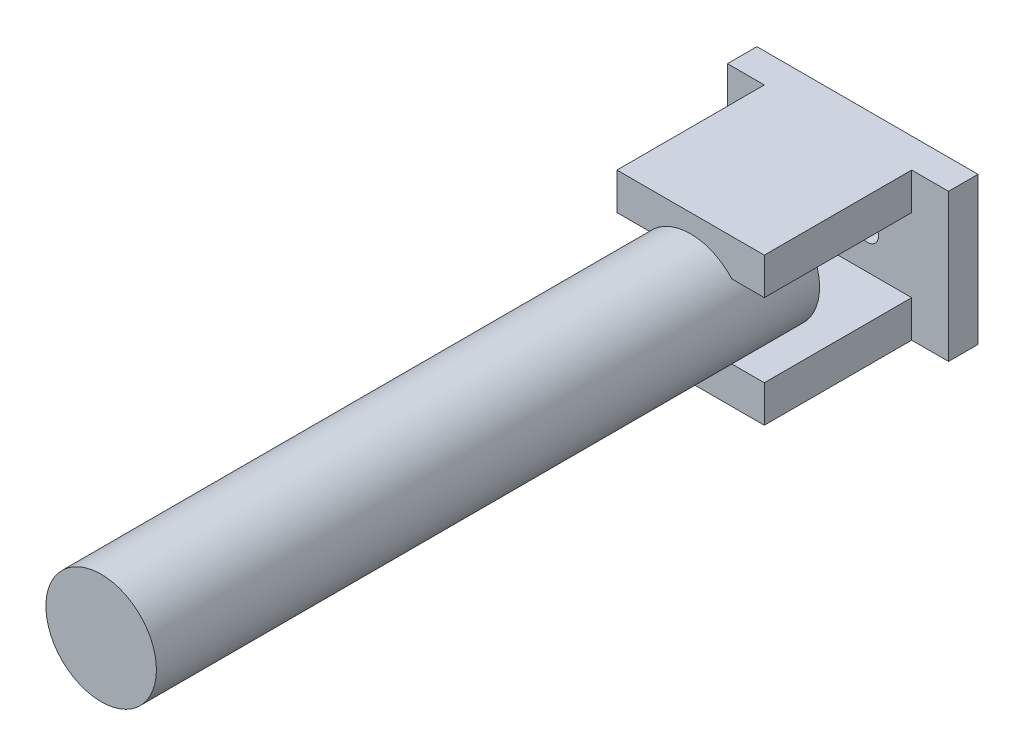
ISO-10303-21;
HEADER;
FILE_DESCRIPTION(('STEP AP214'),'2;1');
FILE_NAME('part.step','',(''),(''),'','','');
FILE_SCHEMA(('AUTOMOTIVE_DESIGN { 1 0 10303 214 1 1 1 1 }'));
ENDSEC;
DATA;
#1=APPLICATION_CONTEXT('core data for automotive mechanical design processes');
#2=APPLICATION_PROTOCOL_DEFINITION('international standard','automotive_design',2000,#1);
#3=PRODUCT_CONTEXT('',#1,'mechanical');
#4=PRODUCT('Part','Part','',(#3));
#5=PRODUCT_RELATED_PRODUCT_CATEGORY('part','',(#4));
#6=PRODUCT_DEFINITION_FORMATION('','',#4);
#7=PRODUCT_DEFINITION_CONTEXT('part definition',#1,'design');
#8=PRODUCT_DEFINITION('design','',#6,#7);
#9=PRODUCT_DEFINITION_SHAPE('','',#8);
#10=(LENGTH_UNIT() NAMED_UNIT(*) SI_UNIT(.MILLI.,.METRE.));
#11=(NAMED_UNIT(*) PLANE_ANGLE_UNIT() SI_UNIT($,.RADIAN.));
#12=(NAMED_UNIT(*) SI_UNIT($,.STERADIAN.) SOLID_ANGLE_UNIT());
#13=UNCERTAINTY_MEASURE_WITH_UNIT(LENGTH_MEASURE(1.E-05),#10,'distance_accuracy_value','');
#14=(GEOMETRIC_REPRESENTATION_CONTEXT(3) GLOBAL_UNCERTAINTY_ASSIGNED_CONTEXT((#13)) GLOBAL_UNIT_ASSIGNED_CONTEXT((#10,
#11,#12)) REPRESENTATION_CONTEXT('',''));
#15=CARTESIAN_POINT('',(0.,0.,0.));
#16=DIRECTION('',(0.,0.,1.));
#17=DIRECTION('',(1.,0.,0.));
#18=AXIS2_PLACEMENT_3D('',#15,#16,#17);
#19=CARTESIAN_POINT('',(0.,0.,4.));
#20=DIRECTION('',(0.,0.,1.));
#21=DIRECTION('',(1.,0.,0.));
#22=AXIS2_PLACEMENT_3D('',#19,#20,#21);
#23=PLANE('',#22);
#24=CARTESIAN_POINT('',(5.09714285714285,0.694285714285715,4.));
#25=DIRECTION('',(0.,0.,1.));
#26=DIRECTION('',(1.,0.,0.));
#27=AXIS2_PLACEMENT_3D('',#24,#25,#26);
#28=CIRCLE('',#27,1.5);
#29=CARTESIAN_POINT('',(6.59714285714285,0.694285714285715,4.));
#30=VERTEX_POINT('',#29);
#31=EDGE_CURVE('E191',#30,#30,#28,.T.);
#32=ORIENTED_EDGE('',*,*,#31,.F.);
#33=EDGE_LOOP('',(#32));
#34=FACE_BOUND('',#33,.T.);
#35=CARTESIAN_POINT('',(-2.90285714285715,0.694285714285715,4.));
#36=DIRECTION('',(0.,0.,1.));
#37=DIRECTION('',(1.,0.,0.));
#38=AXIS2_PLACEMENT_3D('',#35,#36,#37);
#39=CIRCLE('',#38,1.5);
#40=CARTESIAN_POINT('',(-1.40285714285715,0.694285714285715,4.));
#41=VERTEX_POINT('',#40);
#42=EDGE_CURVE('E220',#41,#41,#39,.T.);
#43=ORIENTED_EDGE('',*,*,#42,.F.);
#44=EDGE_LOOP('',(#43));
#45=FACE_BOUND('',#44,.T.);
#46=DIRECTION('',(1.,0.,0.));
#47=VECTOR('',#46,1.);
#48=CARTESIAN_POINT('',(0.,-9.30571428571429,4.));
#49=LINE('',#48,#47);
#50=CARTESIAN_POINT('',(-13.9028571428571,-9.30571428571429,4.));
#51=VERTEX_POINT('',#50);
#52=CARTESIAN_POINT('',(-8.90285714285714,-9.30571428571429,4.));
#53=VERTEX_POINT('',#52);
#54=EDGE_CURVE('E187',#51,#53,#49,.T.);
#55=ORIENTED_EDGE('',*,*,#54,.T.);
#56=DIRECTION('',(0.,-1.,0.));
#57=VECTOR('',#56,1.);
#58=CARTESIAN_POINT('',(-8.90285714285714,0.,4.));
#59=LINE('',#58,#57);
#60=CARTESIAN_POINT('',(-8.90285714285714,-4.30571428571429,4.));
#61=VERTEX_POINT('',#60);
#62=EDGE_CURVE('E267',#61,#53,#59,.T.);
#63=ORIENTED_EDGE('',*,*,#62,.F.);
#64=DIRECTION('',(1.,0.,0.));
#65=VECTOR('',#64,1.);
#66=CARTESIAN_POINT('',(0.,-4.30571428571429,4.));
#67=LINE('',#66,#65);
#68=CARTESIAN_POINT('',(11.0971428571429,-4.30571428571429,4.));
#69=VERTEX_POINT('',#68);
#70=EDGE_CURVE('E270',#61,#69,#67,.T.);
#71=ORIENTED_EDGE('',*,*,#70,.T.);
#72=DIRECTION('',(0.,-1.,0.));
#73=VECTOR('',#72,1.);
#74=CARTESIAN_POINT('',(11.0971428571429,0.,4.));
#75=LINE('',#74,#73);
#76=CARTESIAN_POINT('',(11.0971428571429,-9.30571428571429,4.));
#77=VERTEX_POINT('',#76);
#78=EDGE_CURVE('E162',#69,#77,#75,.T.);
#79=ORIENTED_EDGE('',*,*,#78,.T.);
#80=CARTESIAN_POINT('',(16.0971428571429,-9.30571428571429,4.));
#81=VERTEX_POINT('',#80);
#82=EDGE_CURVE('E209',#77,#81,#49,.T.);
#83=ORIENTED_EDGE('',*,*,#82,.T.);
#84=DIRECTION('',(0.,-1.,0.));
#85=VECTOR('',#84,1.);
#86=CARTESIAN_POINT('',(16.0971428571429,0.,4.));
#87=LINE('',#86,#85);
#88=CARTESIAN_POINT('',(16.0971428571429,10.6942857142857,4.));
#89=VERTEX_POINT('',#88);
#90=EDGE_CURVE('E217',#89,#81,#87,.T.);
#91=ORIENTED_EDGE('',*,*,#90,.F.);
#92=DIRECTION('',(1.,0.,0.));
#93=VECTOR('',#92,1.);
#94=CARTESIAN_POINT('',(0.,10.6942857142857,4.));
#95=LINE('',#94,#93);
#96=CARTESIAN_POINT('',(11.0971428571429,10.6942857142857,4.));
#97=VERTEX_POINT('',#96);
#98=EDGE_CURVE('E216',#97,#89,#95,.T.);
#99=ORIENTED_EDGE('',*,*,#98,.F.);
#100=DIRECTION('',(0.,-1.,0.));
#101=VECTOR('',#100,1.);
#102=CARTESIAN_POINT('',(11.0971428571429,0.,4.));
#103=LINE('',#102,#101);
#104=CARTESIAN_POINT('',(11.0971428571429,5.69428571428571,4.));
#105=VERTEX_POINT('',#104);
#106=EDGE_CURVE('E244',#97,#105,#103,.T.);
#107=ORIENTED_EDGE('',*,*,#106,.T.);
#108=DIRECTION('',(1.,0.,0.));
#109=VECTOR('',#108,1.);
#110=CARTESIAN_POINT('',(0.,5.69428571428571,4.));
#111=LINE('',#110,#109);
#112=CARTESIAN_POINT('',(-8.90285714285714,5.69428571428571,4.));
#113=VERTEX_POINT('',#112);
#114=EDGE_CURVE('E237',#113,#105,#111,.T.);
#115=ORIENTED_EDGE('',*,*,#114,.F.);
#116=DIRECTION('',(0.,-1.,0.));
#117=VECTOR('',#116,1.);
#118=CARTESIAN_POINT('',(-8.90285714285714,0.,4.));
#119=LINE('',#118,#117);
#120=CARTESIAN_POINT('',(-8.90285714285714,10.6942857142857,4.));
#121=VERTEX_POINT('',#120);
#122=EDGE_CURVE('E241',#121,#113,#119,.T.);
#123=ORIENTED_EDGE('',*,*,#122,.F.);
#124=CARTESIAN_POINT('',(-13.9028571428571,10.6942857142857,4.));
#125=VERTEX_POINT('',#124);
#126=EDGE_CURVE('E213',#125,#121,#95,.T.);
#127=ORIENTED_EDGE('',*,*,#126,.F.);
#128=DIRECTION('',(0.,-1.,0.));
#129=VECTOR('',#128,1.);
#130=CARTESIAN_POINT('',(-13.9028571428571,0.,4.));
#131=LINE('',#130,#129);
#132=EDGE_CURVE('E210',#125,#51,#131,.T.);
#133=ORIENTED_EDGE('',*,*,#132,.T.);
#134=EDGE_LOOP('',(#55,#63,#71,#79,#83,#91,#99,#107,#115,#123,#127,#133));
#135=FACE_BOUND('',#134,.T.);
#136=ADVANCED_FACE('F39',(#34,#45,#135),#23,.T.);
#137=CARTESIAN_POINT('',(16.0971428571429,0.,4.));
#138=DIRECTION('',(1.,0.,0.));
#139=DIRECTION('',(0.,1.,0.));
#140=AXIS2_PLACEMENT_3D('',#137,#138,#139);
#141=PLANE('',#140);
#142=DIRECTION('',(0.,-1.,0.));
#143=VECTOR('',#142,1.);
#144=CARTESIAN_POINT('',(16.0971428571429,0.,0.));
#145=LINE('',#144,#143);
#146=CARTESIAN_POINT('',(16.0971428571429,10.6942857142857,0.));
#147=VERTEX_POINT('',#146);
#148=CARTESIAN_POINT('',(16.0971428571429,-9.30571428571429,0.));
#149=VERTEX_POINT('',#148);
#150=EDGE_CURVE('E198',#147,#149,#145,.T.);
#151=ORIENTED_EDGE('',*,*,#150,.F.);
#152=DIRECTION('',(0.,0.,-1.));
#153=VECTOR('',#152,1.);
#154=CARTESIAN_POINT('',(16.0971428571429,10.6942857142857,4.));
#155=LINE('',#154,#153);
#156=EDGE_CURVE('E177',#89,#147,#155,.T.);
#157=ORIENTED_EDGE('',*,*,#156,.F.);
#158=ORIENTED_EDGE('',*,*,#90,.T.);
#159=DIRECTION('',(0.,0.,-1.));
#160=VECTOR('',#159,1.);
#161=CARTESIAN_POINT('',(16.0971428571429,-9.30571428571429,4.));
#162=LINE('',#161,#160);
#163=EDGE_CURVE('E185',#81,#149,#162,.T.);
#164=ORIENTED_EDGE('',*,*,#163,.T.);
#165=EDGE_LOOP('',(#151,#157,#158,#164));
#166=FACE_BOUND('',#165,.T.);
#167=ADVANCED_FACE('F305',(#166),#141,.T.);
#168=CARTESIAN_POINT('',(0.,10.6942857142857,4.));
#169=DIRECTION('',(0.,1.,0.));
#170=DIRECTION('',(0.,0.,1.));
#171=AXIS2_PLACEMENT_3D('',#168,#169,#170);
#172=PLANE('',#171);
#173=DIRECTION('',(1.,0.,0.));
#174=VECTOR('',#173,1.);
#175=CARTESIAN_POINT('',(0.,10.6942857142857,0.));
#176=LINE('',#175,#174);
#177=CARTESIAN_POINT('',(-13.9028571428571,10.6942857142857,0.));
#178=VERTEX_POINT('',#177);
#179=EDGE_CURVE('E195',#178,#147,#176,.T.);
#180=ORIENTED_EDGE('',*,*,#179,.F.);
#181=DIRECTION('',(0.,0.,-1.));
#182=VECTOR('',#181,1.);
#183=CARTESIAN_POINT('',(-13.9028571428571,10.6942857142857,4.));
#184=LINE('',#183,#182);
#185=EDGE_CURVE('E178',#125,#178,#184,.T.);
#186=ORIENTED_EDGE('',*,*,#185,.F.);
#187=ORIENTED_EDGE('',*,*,#126,.T.);
#188=DIRECTION('',(0.,0.,-1.));
#189=VECTOR('',#188,1.);
#190=CARTESIAN_POINT('',(-8.90285714285714,10.6942857142857,24.));
#191=LINE('',#190,#189);
#192=CARTESIAN_POINT('',(-8.90285714285714,10.6942857142857,24.));
#193=VERTEX_POINT('',#192);
#194=EDGE_CURVE('E227',#193,#121,#191,.T.);
#195=ORIENTED_EDGE('',*,*,#194,.F.);
#196=DIRECTION('',(-1.,0.,0.));
#197=VECTOR('',#196,1.);
#198=CARTESIAN_POINT('',(0.,10.6942857142857,24.));
#199=LINE('',#198,#197);
#200=CARTESIAN_POINT('',(11.0971428571429,10.6942857142857,24.));
#201=VERTEX_POINT('',#200);
#202=EDGE_CURVE('E251',#201,#193,#199,.T.);
#203=ORIENTED_EDGE('',*,*,#202,.F.);
#204=DIRECTION('',(0.,0.,-1.));
#205=VECTOR('',#204,1.);
#206=CARTESIAN_POINT('',(11.0971428571429,10.6942857142857,24.));
#207=LINE('',#206,#205);
#208=EDGE_CURVE('E207',#201,#97,#207,.T.);
#209=ORIENTED_EDGE('',*,*,#208,.T.);
#210=ORIENTED_EDGE('',*,*,#98,.T.);
#211=ORIENTED_EDGE('',*,*,#156,.T.);
#212=EDGE_LOOP('',(#180,#186,#187,#195,#203,#209,#210,#211));
#213=FACE_BOUND('',#212,.T.);
#214=ADVANCED_FACE('F311',(#213),#172,.T.);
#215=CARTESIAN_POINT('',(-13.9028571428571,0.,4.));
#216=DIRECTION('',(1.,0.,0.));
#217=DIRECTION('',(0.,1.,0.));
#218=AXIS2_PLACEMENT_3D('',#215,#216,#217);
#219=PLANE('',#218);
#220=DIRECTION('',(0.,-1.,0.));
#221=VECTOR('',#220,1.);
#222=CARTESIAN_POINT('',(-13.9028571428571,0.,0.));
#223=LINE('',#222,#221);
#224=CARTESIAN_POINT('',(-13.9028571428571,-9.30571428571429,0.));
#225=VERTEX_POINT('',#224);
#226=EDGE_CURVE('E192',#178,#225,#223,.T.);
#227=ORIENTED_EDGE('',*,*,#226,.T.);
#228=DIRECTION('',(0.,0.,-1.));
#229=VECTOR('',#228,1.);
#230=CARTESIAN_POINT('',(-13.9028571428571,-9.30571428571429,4.));
#231=LINE('',#230,#229);
#232=EDGE_CURVE('E182',#51,#225,#231,.T.);
#233=ORIENTED_EDGE('',*,*,#232,.F.);
#234=ORIENTED_EDGE('',*,*,#132,.F.);
#235=ORIENTED_EDGE('',*,*,#185,.T.);
#236=EDGE_LOOP('',(#227,#233,#234,#235));
#237=FACE_BOUND('',#236,.T.);
#238=ADVANCED_FACE('F328',(#237),#219,.F.);
#239=CARTESIAN_POINT('',(-2.90285714285715,0.694285714285715,4.));
#240=DIRECTION('',(0.,0.,-1.));
#241=DIRECTION('',(-1.,0.,0.));
#242=AXIS2_PLACEMENT_3D('',#239,#240,#241);
#243=CYLINDRICAL_SURFACE('',#242,1.5);
#244=ORIENTED_EDGE('',*,*,#42,.T.);
#245=EDGE_LOOP('',(#244));
#246=FACE_BOUND('',#245,.T.);
#247=CARTESIAN_POINT('',(-2.90285714285715,0.694285714285715,0.));
#248=DIRECTION('',(0.,0.,1.));
#249=DIRECTION('',(1.,0.,0.));
#250=AXIS2_PLACEMENT_3D('',#247,#248,#249);
#251=CIRCLE('',#250,1.5);
#252=CARTESIAN_POINT('',(-1.40285714285715,0.694285714285715,0.));
#253=VERTEX_POINT('',#252);
#254=EDGE_CURVE('E201',#253,#253,#251,.T.);
#255=ORIENTED_EDGE('',*,*,#254,.F.);
#256=EDGE_LOOP('',(#255));
#257=FACE_BOUND('',#256,.T.);
#258=ADVANCED_FACE('F331',(#246,#257),#243,.F.);
#259=CARTESIAN_POINT('',(5.09714285714285,0.694285714285715,4.));
#260=DIRECTION('',(0.,0.,-1.));
#261=DIRECTION('',(-1.,0.,0.));
#262=AXIS2_PLACEMENT_3D('',#259,#260,#261);
#263=CYLINDRICAL_SURFACE('',#262,1.5);
#264=ORIENTED_EDGE('',*,*,#31,.T.);
#265=EDGE_LOOP('',(#264));
#266=FACE_BOUND('',#265,.T.);
#267=CARTESIAN_POINT('',(5.09714285714285,0.694285714285715,0.));
#268=DIRECTION('',(0.,0.,1.));
#269=DIRECTION('',(1.,0.,0.));
#270=AXIS2_PLACEMENT_3D('',#267,#268,#269);
#271=CIRCLE('',#270,1.5);
#272=CARTESIAN_POINT('',(6.59714285714285,0.694285714285715,0.));
#273=VERTEX_POINT('',#272);
#274=EDGE_CURVE('E204',#273,#273,#271,.T.);
#275=ORIENTED_EDGE('',*,*,#274,.F.);
#276=EDGE_LOOP('',(#275));
#277=FACE_BOUND('',#276,.T.);
#278=ADVANCED_FACE('F41',(#266,#277),#263,.F.);
#279=CARTESIAN_POINT('',(0.,-9.30571428571429,4.));
#280=DIRECTION('',(0.,1.,0.));
#281=DIRECTION('',(0.,0.,1.));
#282=AXIS2_PLACEMENT_3D('',#279,#280,#281);
#283=PLANE('',#282);
#284=DIRECTION('',(1.,0.,0.));
#285=VECTOR('',#284,1.);
#286=CARTESIAN_POINT('',(0.,-9.30571428571429,0.));
#287=LINE('',#286,#285);
#288=EDGE_CURVE('E188',#225,#149,#287,.T.);
#289=ORIENTED_EDGE('',*,*,#288,.T.);
#290=ORIENTED_EDGE('',*,*,#163,.F.);
#291=ORIENTED_EDGE('',*,*,#82,.F.);
#292=DIRECTION('',(0.,0.,-1.));
#293=VECTOR('',#292,1.);
#294=CARTESIAN_POINT('',(11.0971428571429,-9.30571428571429,24.));
#295=LINE('',#294,#293);
#296=CARTESIAN_POINT('',(11.0971428571429,-9.30571428571429,24.));
#297=VERTEX_POINT('',#296);
#298=EDGE_CURVE('E260',#297,#77,#295,.T.);
#299=ORIENTED_EDGE('',*,*,#298,.F.);
#300=DIRECTION('',(1.,0.,0.));
#301=VECTOR('',#300,1.);
#302=CARTESIAN_POINT('',(0.,-9.30571428571429,24.));
#303=LINE('',#302,#301);
#304=CARTESIAN_POINT('',(-8.90285714285714,-9.30571428571429,24.));
#305=VERTEX_POINT('',#304);
#306=EDGE_CURVE('E273',#305,#297,#303,.T.);
#307=ORIENTED_EDGE('',*,*,#306,.F.);
#308=DIRECTION('',(0.,0.,-1.));
#309=VECTOR('',#308,1.);
#310=CARTESIAN_POINT('',(-8.90285714285714,-9.30571428571429,24.));
#311=LINE('',#310,#309);
#312=EDGE_CURVE('E257',#305,#53,#311,.T.);
#313=ORIENTED_EDGE('',*,*,#312,.T.);
#314=ORIENTED_EDGE('',*,*,#54,.F.);
#315=ORIENTED_EDGE('',*,*,#232,.T.);
#316=EDGE_LOOP('',(#289,#290,#291,#299,#307,#313,#314,#315));
#317=FACE_BOUND('',#316,.T.);
#318=ADVANCED_FACE('F323',(#317),#283,.F.);
#319=CARTESIAN_POINT('',(0.,0.,0.));
#320=DIRECTION('',(0.,0.,1.));
#321=DIRECTION('',(1.,0.,0.));
#322=AXIS2_PLACEMENT_3D('',#319,#320,#321);
#323=PLANE('',#322);
#324=ORIENTED_EDGE('',*,*,#274,.T.);
#325=EDGE_LOOP('',(#324));
#326=FACE_BOUND('',#325,.T.);
#327=ORIENTED_EDGE('',*,*,#254,.T.);
#328=EDGE_LOOP('',(#327));
#329=FACE_BOUND('',#328,.T.);
#330=ORIENTED_EDGE('',*,*,#150,.T.);
#331=ORIENTED_EDGE('',*,*,#288,.F.);
#332=ORIENTED_EDGE('',*,*,#226,.F.);
#333=ORIENTED_EDGE('',*,*,#179,.T.);
#334=EDGE_LOOP('',(#330,#331,#332,#333));
#335=FACE_BOUND('',#334,.T.);
#336=ADVANCED_FACE('F320',(#326,#329,#335),#323,.F.);
#337=CARTESIAN_POINT('',(11.0971428571429,0.,24.));
#338=DIRECTION('',(1.,0.,0.));
#339=DIRECTION('',(0.,1.,0.));
#340=AXIS2_PLACEMENT_3D('',#337,#338,#339);
#341=PLANE('',#340);
#342=ORIENTED_EDGE('',*,*,#106,.F.);
#343=ORIENTED_EDGE('',*,*,#208,.F.);
#344=DIRECTION('',(0.,-1.,0.));
#345=VECTOR('',#344,1.);
#346=CARTESIAN_POINT('',(11.0971428571429,0.,24.));
#347=LINE('',#346,#345);
#348=CARTESIAN_POINT('',(11.0971428571429,5.69428571428571,24.));
#349=VERTEX_POINT('',#348);
#350=EDGE_CURVE('E240',#201,#349,#347,.T.);
#351=ORIENTED_EDGE('',*,*,#350,.T.);
#352=DIRECTION('',(0.,0.,-1.));
#353=VECTOR('',#352,1.);
#354=CARTESIAN_POINT('',(11.0971428571429,5.69428571428571,24.));
#355=LINE('',#354,#353);
#356=EDGE_CURVE('E233',#349,#105,#355,.T.);
#357=ORIENTED_EDGE('',*,*,#356,.T.);
#358=EDGE_LOOP('',(#342,#343,#351,#357));
#359=FACE_BOUND('',#358,.T.);
#360=ADVANCED_FACE('F318',(#359),#341,.T.);
#361=CARTESIAN_POINT('',(-8.90285714285714,0.,24.));
#362=DIRECTION('',(1.,0.,0.));
#363=DIRECTION('',(0.,1.,0.));
#364=AXIS2_PLACEMENT_3D('',#361,#362,#363);
#365=PLANE('',#364);
#366=ORIENTED_EDGE('',*,*,#122,.T.);
#367=DIRECTION('',(0.,0.,-1.));
#368=VECTOR('',#367,1.);
#369=CARTESIAN_POINT('',(-8.90285714285714,5.69428571428571,24.));
#370=LINE('',#369,#368);
#371=CARTESIAN_POINT('',(-8.90285714285714,5.69428571428571,24.));
#372=VERTEX_POINT('',#371);
#373=EDGE_CURVE('E230',#372,#113,#370,.T.);
#374=ORIENTED_EDGE('',*,*,#373,.F.);
#375=DIRECTION('',(0.,-1.,0.));
#376=VECTOR('',#375,1.);
#377=CARTESIAN_POINT('',(-8.90285714285714,0.,24.));
#378=LINE('',#377,#376);
#379=EDGE_CURVE('E249',#193,#372,#378,.T.);
#380=ORIENTED_EDGE('',*,*,#379,.F.);
#381=ORIENTED_EDGE('',*,*,#194,.T.);
#382=EDGE_LOOP('',(#366,#374,#380,#381));
#383=FACE_BOUND('',#382,.T.);
#384=ADVANCED_FACE('F377',(#383),#365,.F.);
#385=CARTESIAN_POINT('',(0.,5.69428571428571,24.));
#386=DIRECTION('',(0.,1.,0.));
#387=DIRECTION('',(0.,0.,1.));
#388=AXIS2_PLACEMENT_3D('',#385,#386,#387);
#389=PLANE('',#388);
#390=DIRECTION('',(1.,0.,0.));
#391=VECTOR('',#390,1.);
#392=CARTESIAN_POINT('',(0.,5.69428571428571,14.));
#393=LINE('',#392,#391);
#394=CARTESIAN_POINT('',(-4.49302708660661,5.69428571428571,14.));
#395=VERTEX_POINT('',#394);
#396=CARTESIAN_POINT('',(6.68731280089234,5.69428571428571,14.));
#397=VERTEX_POINT('',#396);
#398=EDGE_CURVE('E58',#395,#397,#393,.T.);
#399=ORIENTED_EDGE('',*,*,#398,.F.);
#400=DIRECTION('',(0.,0.,1.));
#401=VECTOR('',#400,1.);
#402=CARTESIAN_POINT('',(-4.49302708660661,5.69428571428571,14.));
#403=LINE('',#402,#401);
#404=CARTESIAN_POINT('',(-4.49302708660661,5.69428571428571,24.));
#405=VERTEX_POINT('',#404);
#406=EDGE_CURVE('E278',#395,#405,#403,.T.);
#407=ORIENTED_EDGE('',*,*,#406,.T.);
#408=DIRECTION('',(1.,0.,0.));
#409=VECTOR('',#408,1.);
#410=CARTESIAN_POINT('',(0.,5.69428571428571,24.));
#411=LINE('',#410,#409);
#412=EDGE_CURVE('E236',#372,#405,#411,.T.);
#413=ORIENTED_EDGE('',*,*,#412,.F.);
#414=ORIENTED_EDGE('',*,*,#373,.T.);
#415=ORIENTED_EDGE('',*,*,#114,.T.);
#416=ORIENTED_EDGE('',*,*,#356,.F.);
#417=CARTESIAN_POINT('',(6.68731280089234,5.69428571428571,24.));
#418=VERTEX_POINT('',#417);
#419=EDGE_CURVE('E248',#418,#349,#411,.T.);
#420=ORIENTED_EDGE('',*,*,#419,.F.);
#421=DIRECTION('',(0.,0.,1.));
#422=VECTOR('',#421,1.);
#423=CARTESIAN_POINT('',(6.68731280089234,5.69428571428571,14.));
#424=LINE('',#423,#422);
#425=EDGE_CURVE('E54',#418,#397,#424,.F.);
#426=ORIENTED_EDGE('',*,*,#425,.T.);
#427=EDGE_LOOP('',(#399,#407,#413,#414,#415,#416,#420,#426));
#428=FACE_BOUND('',#427,.T.);
#429=ADVANCED_FACE('F369',(#428),#389,.F.);
#430=CARTESIAN_POINT('',(0.,0.,24.));
#431=DIRECTION('',(0.,0.,1.));
#432=DIRECTION('',(1.,0.,0.));
#433=AXIS2_PLACEMENT_3D('',#430,#431,#432);
#434=PLANE('',#433);
#435=CARTESIAN_POINT('',(1.09714285714286,0.694285714285715,24.));
#436=DIRECTION('',(0.,0.,1.));
#437=DIRECTION('',(1.,0.,0.));
#438=AXIS2_PLACEMENT_3D('',#435,#436,#437);
#439=CIRCLE('',#438,7.5);
#440=EDGE_CURVE('E281',#418,#405,#439,.T.);
#441=ORIENTED_EDGE('',*,*,#440,.F.);
#442=ORIENTED_EDGE('',*,*,#419,.T.);
#443=ORIENTED_EDGE('',*,*,#350,.F.);
#444=ORIENTED_EDGE('',*,*,#202,.T.);
#445=ORIENTED_EDGE('',*,*,#379,.T.);
#446=ORIENTED_EDGE('',*,*,#412,.T.);
#447=EDGE_LOOP('',(#441,#442,#443,#444,#445,#446));
#448=FACE_BOUND('',#447,.T.);
#449=ADVANCED_FACE('F372',(#448),#434,.T.);
#450=CARTESIAN_POINT('',(0.,-4.30571428571429,24.));
#451=DIRECTION('',(0.,1.,0.));
#452=DIRECTION('',(0.,0.,1.));
#453=AXIS2_PLACEMENT_3D('',#450,#451,#452);
#454=PLANE('',#453);
#455=DIRECTION('',(0.,0.,1.));
#456=VECTOR('',#455,1.);
#457=CARTESIAN_POINT('',(-4.49302708660661,-4.30571428571429,14.));
#458=LINE('',#457,#456);
#459=CARTESIAN_POINT('',(-4.49302708660661,-4.30571428571429,14.));
#460=VERTEX_POINT('',#459);
#461=CARTESIAN_POINT('',(-4.49302708660661,-4.30571428571429,24.));
#462=VERTEX_POINT('',#461);
#463=EDGE_CURVE('E171',#460,#462,#458,.T.);
#464=ORIENTED_EDGE('',*,*,#463,.F.);
#465=DIRECTION('',(1.,0.,0.));
#466=VECTOR('',#465,1.);
#467=CARTESIAN_POINT('',(0.,-4.30571428571429,14.));
#468=LINE('',#467,#466);
#469=CARTESIAN_POINT('',(6.68731280089234,-4.30571428571429,14.));
#470=VERTEX_POINT('',#469);
#471=EDGE_CURVE('E11',#460,#470,#468,.T.);
#472=ORIENTED_EDGE('',*,*,#471,.T.);
#473=DIRECTION('',(0.,0.,1.));
#474=VECTOR('',#473,1.);
#475=CARTESIAN_POINT('',(6.68731280089234,-4.30571428571429,14.));
#476=LINE('',#475,#474);
#477=CARTESIAN_POINT('',(6.68731280089234,-4.30571428571429,24.));
#478=VERTEX_POINT('',#477);
#479=EDGE_CURVE('E165',#478,#470,#476,.F.);
#480=ORIENTED_EDGE('',*,*,#479,.F.);
#481=DIRECTION('',(1.,0.,0.));
#482=VECTOR('',#481,1.);
#483=CARTESIAN_POINT('',(0.,-4.30571428571429,24.));
#484=LINE('',#483,#482);
#485=CARTESIAN_POINT('',(11.0971428571429,-4.30571428571429,24.));
#486=VERTEX_POINT('',#485);
#487=EDGE_CURVE('E150',#478,#486,#484,.T.);
#488=ORIENTED_EDGE('',*,*,#487,.T.);
#489=DIRECTION('',(0.,0.,-1.));
#490=VECTOR('',#489,1.);
#491=CARTESIAN_POINT('',(11.0971428571429,-4.30571428571429,24.));
#492=LINE('',#491,#490);
#493=EDGE_CURVE('E263',#486,#69,#492,.T.);
#494=ORIENTED_EDGE('',*,*,#493,.T.);
#495=ORIENTED_EDGE('',*,*,#70,.F.);
#496=DIRECTION('',(0.,0.,-1.));
#497=VECTOR('',#496,1.);
#498=CARTESIAN_POINT('',(-8.90285714285714,-4.30571428571429,24.));
#499=LINE('',#498,#497);
#500=CARTESIAN_POINT('',(-8.90285714285714,-4.30571428571429,24.));
#501=VERTEX_POINT('',#500);
#502=EDGE_CURVE('E246',#501,#61,#499,.T.);
#503=ORIENTED_EDGE('',*,*,#502,.F.);
#504=EDGE_CURVE('E161',#501,#462,#484,.T.);
#505=ORIENTED_EDGE('',*,*,#504,.T.);
#506=EDGE_LOOP('',(#464,#472,#480,#488,#494,#495,#503,#505));
#507=FACE_BOUND('',#506,.T.);
#508=ADVANCED_FACE('F166',(#507),#454,.T.);
#509=CARTESIAN_POINT('',(-8.90285714285714,0.,24.));
#510=DIRECTION('',(1.,0.,0.));
#511=DIRECTION('',(0.,1.,0.));
#512=AXIS2_PLACEMENT_3D('',#509,#510,#511);
#513=PLANE('',#512);
#514=ORIENTED_EDGE('',*,*,#62,.T.);
#515=ORIENTED_EDGE('',*,*,#312,.F.);
#516=DIRECTION('',(0.,-1.,0.));
#517=VECTOR('',#516,1.);
#518=CARTESIAN_POINT('',(-8.90285714285714,0.,24.));
#519=LINE('',#518,#517);
#520=EDGE_CURVE('E275',#501,#305,#519,.T.);
#521=ORIENTED_EDGE('',*,*,#520,.F.);
#522=ORIENTED_EDGE('',*,*,#502,.T.);
#523=EDGE_LOOP('',(#514,#515,#521,#522));
#524=FACE_BOUND('',#523,.T.);
#525=ADVANCED_FACE('F366',(#524),#513,.F.);
#526=CARTESIAN_POINT('',(11.0971428571429,0.,24.));
#527=DIRECTION('',(1.,0.,0.));
#528=DIRECTION('',(0.,1.,0.));
#529=AXIS2_PLACEMENT_3D('',#526,#527,#528);
#530=PLANE('',#529);
#531=ORIENTED_EDGE('',*,*,#78,.F.);
#532=ORIENTED_EDGE('',*,*,#493,.F.);
#533=DIRECTION('',(0.,-1.,0.));
#534=VECTOR('',#533,1.);
#535=CARTESIAN_POINT('',(11.0971428571429,0.,24.));
#536=LINE('',#535,#534);
#537=EDGE_CURVE('E157',#486,#297,#536,.T.);
#538=ORIENTED_EDGE('',*,*,#537,.T.);
#539=ORIENTED_EDGE('',*,*,#298,.T.);
#540=EDGE_LOOP('',(#531,#532,#538,#539));
#541=FACE_BOUND('',#540,.T.);
#542=ADVANCED_FACE('F361',(#541),#530,.T.);
#543=CARTESIAN_POINT('',(0.,0.,24.));
#544=DIRECTION('',(0.,0.,1.));
#545=DIRECTION('',(1.,0.,0.));
#546=AXIS2_PLACEMENT_3D('',#543,#544,#545);
#547=PLANE('',#546);
#548=CARTESIAN_POINT('',(1.09714285714286,0.694285714285715,24.));
#549=DIRECTION('',(0.,0.,1.));
#550=DIRECTION('',(1.,0.,0.));
#551=AXIS2_PLACEMENT_3D('',#548,#549,#550);
#552=CIRCLE('',#551,7.5);
#553=EDGE_CURVE('E47',#462,#478,#552,.T.);
#554=ORIENTED_EDGE('',*,*,#553,.F.);
#555=ORIENTED_EDGE('',*,*,#504,.F.);
#556=ORIENTED_EDGE('',*,*,#520,.T.);
#557=ORIENTED_EDGE('',*,*,#306,.T.);
#558=ORIENTED_EDGE('',*,*,#537,.F.);
#559=ORIENTED_EDGE('',*,*,#487,.F.);
#560=EDGE_LOOP('',(#554,#555,#556,#557,#558,#559));
#561=FACE_BOUND('',#560,.T.);
#562=ADVANCED_FACE('F152',(#561),#547,.T.);
#563=CARTESIAN_POINT('',(1.09714285714286,0.694285714285715,14.));
#564=DIRECTION('',(0.,0.,1.));
#565=DIRECTION('',(1.,0.,0.));
#566=AXIS2_PLACEMENT_3D('',#563,#564,#565);
#567=PLANE('',#566);
#568=CARTESIAN_POINT('',(1.09714285714286,0.694285714285715,14.));
#569=DIRECTION('',(0.,0.,1.));
#570=DIRECTION('',(1.,0.,0.));
#571=AXIS2_PLACEMENT_3D('',#568,#569,#570);
#572=CIRCLE('',#571,7.5);
#573=EDGE_CURVE('E172',#395,#460,#572,.T.);
#574=ORIENTED_EDGE('',*,*,#573,.F.);
#575=ORIENTED_EDGE('',*,*,#398,.T.);
#576=EDGE_CURVE('E285',#470,#397,#572,.T.);
#577=ORIENTED_EDGE('',*,*,#576,.F.);
#578=ORIENTED_EDGE('',*,*,#471,.F.);
#579=EDGE_LOOP('',(#574,#575,#577,#578));
#580=FACE_BOUND('',#579,.T.);
#581=ADVANCED_FACE('F294',(#580),#567,.F.);
#582=CARTESIAN_POINT('',(1.09714285714286,0.694285714285715,14.));
#583=DIRECTION('',(0.,0.,1.));
#584=DIRECTION('',(1.,0.,0.));
#585=AXIS2_PLACEMENT_3D('',#582,#583,#584);
#586=CYLINDRICAL_SURFACE('',#585,7.5);
#587=CARTESIAN_POINT('',(1.09714285714286,0.694285714285715,104.));
#588=DIRECTION('',(0.,0.,1.));
#589=DIRECTION('',(1.,0.,0.));
#590=AXIS2_PLACEMENT_3D('',#587,#588,#589);
#591=CIRCLE('',#590,7.5);
#592=CARTESIAN_POINT('',(8.59714285714286,0.694285714285715,104.));
#593=VERTEX_POINT('',#592);
#594=EDGE_CURVE('E287',#593,#593,#591,.T.);
#595=ORIENTED_EDGE('',*,*,#594,.F.);
#596=EDGE_LOOP('',(#595));
#597=FACE_BOUND('',#596,.T.);
#598=ORIENTED_EDGE('',*,*,#406,.F.);
#599=ORIENTED_EDGE('',*,*,#573,.T.);
#600=ORIENTED_EDGE('',*,*,#463,.T.);
#601=ORIENTED_EDGE('',*,*,#553,.T.);
#602=ORIENTED_EDGE('',*,*,#479,.T.);
#603=ORIENTED_EDGE('',*,*,#576,.T.);
#604=ORIENTED_EDGE('',*,*,#425,.F.);
#605=ORIENTED_EDGE('',*,*,#440,.T.);
#606=EDGE_LOOP('',(#598,#599,#600,#601,#602,#603,#604,#605));
#607=FACE_BOUND('',#606,.T.);
#608=ADVANCED_FACE('F175',(#597,#607),#586,.T.);
#609=CARTESIAN_POINT('',(1.09714285714286,0.694285714285715,104.));
#610=DIRECTION('',(0.,0.,1.));
#611=DIRECTION('',(1.,0.,0.));
#612=AXIS2_PLACEMENT_3D('',#609,#610,#611);
#613=PLANE('',#612);
#614=ORIENTED_EDGE('',*,*,#594,.T.);
#615=EDGE_LOOP('',(#614));
#616=FACE_BOUND('',#615,.T.);
#617=ADVANCED_FACE('F291',(#616),#613,.T.);
#618=CLOSED_SHELL('',(#136,#167,#214,#238,#258,#278,#318,#336,#360,#384,#429,#449,#508,#525,
#542,#562,#581,#608,#617));
#619=MANIFOLD_SOLID_BREP('B2',#618);
#620=ADVANCED_BREP_SHAPE_REPRESENTATION('',(#18,#619),#14);
#621=SHAPE_DEFINITION_REPRESENTATION(#9,#620);
ENDSEC;
END-ISO-10303-21;
